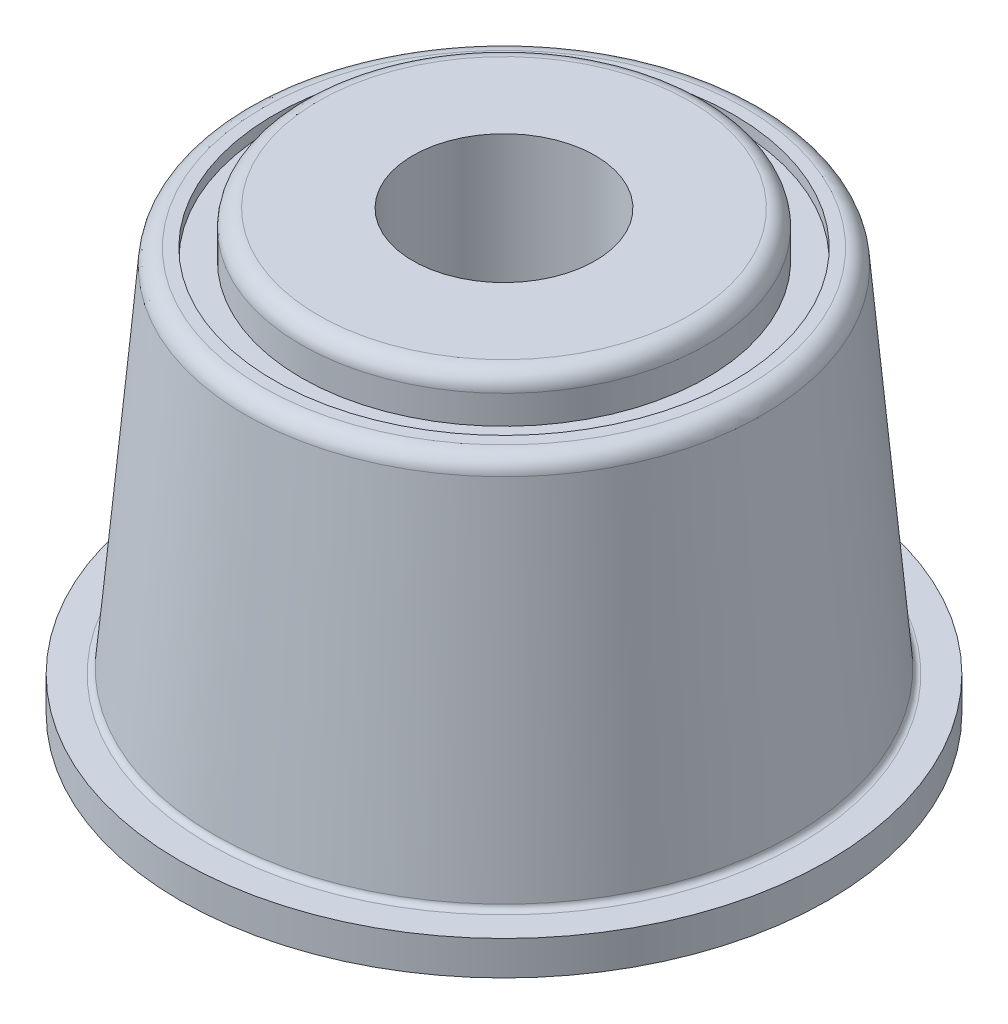
ISO-10303-21;
HEADER;
FILE_DESCRIPTION(('STEP AP214'),'2;1');
FILE_NAME('part.step','',(''),(''),'','','');
FILE_SCHEMA(('AUTOMOTIVE_DESIGN { 1 0 10303 214 1 1 1 1 }'));
ENDSEC;
DATA;
#1=APPLICATION_CONTEXT('core data for automotive mechanical design processes');
#2=APPLICATION_PROTOCOL_DEFINITION('international standard','automotive_design',2000,#1);
#3=PRODUCT_CONTEXT('',#1,'mechanical');
#4=PRODUCT('Part','Part','',(#3));
#5=PRODUCT_RELATED_PRODUCT_CATEGORY('part','',(#4));
#6=PRODUCT_DEFINITION_FORMATION('','',#4);
#7=PRODUCT_DEFINITION_CONTEXT('part definition',#1,'design');
#8=PRODUCT_DEFINITION('design','',#6,#7);
#9=PRODUCT_DEFINITION_SHAPE('','',#8);
#10=(LENGTH_UNIT() NAMED_UNIT(*) SI_UNIT(.MILLI.,.METRE.));
#11=(NAMED_UNIT(*) PLANE_ANGLE_UNIT() SI_UNIT($,.RADIAN.));
#12=(NAMED_UNIT(*) SI_UNIT($,.STERADIAN.) SOLID_ANGLE_UNIT());
#13=UNCERTAINTY_MEASURE_WITH_UNIT(LENGTH_MEASURE(1.E-05),#10,'distance_accuracy_value','');
#14=(GEOMETRIC_REPRESENTATION_CONTEXT(3) GLOBAL_UNCERTAINTY_ASSIGNED_CONTEXT((#13)) GLOBAL_UNIT_ASSIGNED_CONTEXT((#10,
#11,#12)) REPRESENTATION_CONTEXT('',''));
#15=CARTESIAN_POINT('',(0.,0.,0.));
#16=DIRECTION('',(0.,0.,1.));
#17=DIRECTION('',(1.,0.,0.));
#18=AXIS2_PLACEMENT_3D('',#15,#16,#17);
#19=CARTESIAN_POINT('',(0.,9.225,0.));
#20=DIRECTION('',(0.,-1.,0.));
#21=DIRECTION('',(0.,0.,-1.));
#22=AXIS2_PLACEMENT_3D('',#19,#20,#21);
#23=TOROIDAL_SURFACE('',#22,4.07,0.374999999999999);
#24=CARTESIAN_POINT('',(0.,9.6,0.));
#25=DIRECTION('',(0.,-1.,0.));
#26=DIRECTION('',(0.,0.,-1.));
#27=AXIS2_PLACEMENT_3D('',#24,#25,#26);
#28=CIRCLE('',#27,4.07);
#29=CARTESIAN_POINT('',(0.,9.6,-4.07));
#30=VERTEX_POINT('',#29);
#31=EDGE_CURVE('E10',#30,#30,#28,.T.);
#32=ORIENTED_EDGE('',*,*,#31,.T.);
#33=EDGE_LOOP('',(#32));
#34=FACE_BOUND('',#33,.T.);
#35=CARTESIAN_POINT('',(0.,9.225,0.));
#36=DIRECTION('',(0.,-1.,0.));
#37=DIRECTION('',(0.,0.,-1.));
#38=AXIS2_PLACEMENT_3D('',#35,#36,#37);
#39=CIRCLE('',#38,4.445);
#40=CARTESIAN_POINT('',(0.,9.225,-4.445));
#41=VERTEX_POINT('',#40);
#42=EDGE_CURVE('E80',#41,#41,#39,.T.);
#43=ORIENTED_EDGE('',*,*,#42,.F.);
#44=EDGE_LOOP('',(#43));
#45=FACE_BOUND('',#44,.T.);
#46=ADVANCED_FACE('F28',(#34,#45),#23,.T.);
#47=CARTESIAN_POINT('',(4.07,9.6,0.));
#48=DIRECTION('',(0.,1.,0.));
#49=DIRECTION('',(0.,0.,1.));
#50=AXIS2_PLACEMENT_3D('',#47,#48,#49);
#51=PLANE('',#50);
#52=CARTESIAN_POINT('',(0.,9.6,0.));
#53=DIRECTION('',(0.,-1.,0.));
#54=DIRECTION('',(0.,0.,-1.));
#55=AXIS2_PLACEMENT_3D('',#52,#53,#54);
#56=CIRCLE('',#55,2.);
#57=CARTESIAN_POINT('',(0.,9.6,-2.));
#58=VERTEX_POINT('',#57);
#59=EDGE_CURVE('E34',#58,#58,#56,.T.);
#60=ORIENTED_EDGE('',*,*,#59,.T.);
#61=EDGE_LOOP('',(#60));
#62=FACE_BOUND('',#61,.T.);
#63=ORIENTED_EDGE('',*,*,#31,.F.);
#64=EDGE_LOOP('',(#63));
#65=FACE_BOUND('',#64,.T.);
#66=ADVANCED_FACE('F88',(#62,#65),#51,.T.);
#67=CARTESIAN_POINT('',(0.,9.60267581021841,0.));
#68=DIRECTION('',(0.,-1.,0.));
#69=DIRECTION('',(0.,0.,-1.));
#70=AXIS2_PLACEMENT_3D('',#67,#68,#69);
#71=CYLINDRICAL_SURFACE('',#70,2.);
#72=CARTESIAN_POINT('',(0.,-0.750000000000001,0.));
#73=DIRECTION('',(0.,-1.,0.));
#74=DIRECTION('',(0.,0.,-1.));
#75=AXIS2_PLACEMENT_3D('',#72,#73,#74);
#76=CIRCLE('',#75,2.);
#77=CARTESIAN_POINT('',(0.,-0.750000000000001,-2.));
#78=VERTEX_POINT('',#77);
#79=EDGE_CURVE('E38',#78,#78,#76,.T.);
#80=ORIENTED_EDGE('',*,*,#79,.T.);
#81=EDGE_LOOP('',(#80));
#82=FACE_BOUND('',#81,.T.);
#83=ORIENTED_EDGE('',*,*,#59,.F.);
#84=EDGE_LOOP('',(#83));
#85=FACE_BOUND('',#84,.T.);
#86=ADVANCED_FACE('F92',(#82,#85),#71,.F.);
#87=CARTESIAN_POINT('',(2.,-0.75,0.));
#88=DIRECTION('',(0.,-1.,0.));
#89=DIRECTION('',(0.,0.,-1.));
#90=AXIS2_PLACEMENT_3D('',#87,#88,#89);
#91=PLANE('',#90);
#92=CARTESIAN_POINT('',(0.,-0.750000000000001,0.));
#93=DIRECTION('',(0.,-1.,0.));
#94=DIRECTION('',(0.,0.,-1.));
#95=AXIS2_PLACEMENT_3D('',#92,#93,#94);
#96=CIRCLE('',#95,4.445);
#97=CARTESIAN_POINT('',(0.,-0.750000000000001,-4.445));
#98=VERTEX_POINT('',#97);
#99=EDGE_CURVE('E42',#98,#98,#96,.T.);
#100=ORIENTED_EDGE('',*,*,#99,.T.);
#101=EDGE_LOOP('',(#100));
#102=FACE_BOUND('',#101,.T.);
#103=ORIENTED_EDGE('',*,*,#79,.F.);
#104=EDGE_LOOP('',(#103));
#105=FACE_BOUND('',#104,.T.);
#106=ADVANCED_FACE('F96',(#102,#105),#91,.T.);
#107=CARTESIAN_POINT('',(0.,9.60267581021841,0.));
#108=DIRECTION('',(0.,-1.,0.));
#109=DIRECTION('',(0.,0.,-1.));
#110=AXIS2_PLACEMENT_3D('',#107,#108,#109);
#111=CYLINDRICAL_SURFACE('',#110,4.445);
#112=CARTESIAN_POINT('',(0.,-0.125,0.));
#113=DIRECTION('',(0.,-1.,0.));
#114=DIRECTION('',(0.,0.,-1.));
#115=AXIS2_PLACEMENT_3D('',#112,#113,#114);
#116=CIRCLE('',#115,4.445);
#117=CARTESIAN_POINT('',(0.,-0.125,-4.445));
#118=VERTEX_POINT('',#117);
#119=EDGE_CURVE('E47',#118,#118,#116,.T.);
#120=ORIENTED_EDGE('',*,*,#119,.T.);
#121=EDGE_LOOP('',(#120));
#122=FACE_BOUND('',#121,.T.);
#123=ORIENTED_EDGE('',*,*,#99,.F.);
#124=EDGE_LOOP('',(#123));
#125=FACE_BOUND('',#124,.T.);
#126=ADVANCED_FACE('F103',(#122,#125),#111,.T.);
#127=CARTESIAN_POINT('',(0.,-0.125,0.));
#128=DIRECTION('',(0.,-1.,0.));
#129=DIRECTION('',(0.,0.,-1.));
#130=AXIS2_PLACEMENT_3D('',#127,#128,#129);
#131=TOROIDAL_SURFACE('',#130,4.57,0.125);
#132=CARTESIAN_POINT('',(0.,0.,0.));
#133=DIRECTION('',(0.,-1.,0.));
#134=DIRECTION('',(0.,0.,-1.));
#135=AXIS2_PLACEMENT_3D('',#132,#133,#134);
#136=CIRCLE('',#135,4.57);
#137=CARTESIAN_POINT('',(0.,0.,-4.57));
#138=VERTEX_POINT('',#137);
#139=EDGE_CURVE('E50',#138,#138,#136,.T.);
#140=ORIENTED_EDGE('',*,*,#139,.T.);
#141=EDGE_LOOP('',(#140));
#142=FACE_BOUND('',#141,.T.);
#143=ORIENTED_EDGE('',*,*,#119,.F.);
#144=EDGE_LOOP('',(#143));
#145=FACE_BOUND('',#144,.T.);
#146=ADVANCED_FACE('F107',(#142,#145),#131,.F.);
#147=CARTESIAN_POINT('',(4.57,0.,0.));
#148=DIRECTION('',(0.,-1.,0.));
#149=DIRECTION('',(0.,0.,-1.));
#150=AXIS2_PLACEMENT_3D('',#147,#148,#149);
#151=PLANE('',#150);
#152=CARTESIAN_POINT('',(0.,0.,0.));
#153=DIRECTION('',(0.,-1.,0.));
#154=DIRECTION('',(0.,0.,-1.));
#155=AXIS2_PLACEMENT_3D('',#152,#153,#154);
#156=CIRCLE('',#155,7.1);
#157=CARTESIAN_POINT('',(0.,0.,-7.1));
#158=VERTEX_POINT('',#157);
#159=EDGE_CURVE('E53',#158,#158,#156,.T.);
#160=ORIENTED_EDGE('',*,*,#159,.T.);
#161=EDGE_LOOP('',(#160));
#162=FACE_BOUND('',#161,.T.);
#163=ORIENTED_EDGE('',*,*,#139,.F.);
#164=EDGE_LOOP('',(#163));
#165=FACE_BOUND('',#164,.T.);
#166=ADVANCED_FACE('F111',(#162,#165),#151,.T.);
#167=CARTESIAN_POINT('',(0.,9.60267581021841,0.));
#168=DIRECTION('',(0.,-1.,0.));
#169=DIRECTION('',(0.,0.,-1.));
#170=AXIS2_PLACEMENT_3D('',#167,#168,#169);
#171=CYLINDRICAL_SURFACE('',#170,7.1);
#172=CARTESIAN_POINT('',(0.,0.750000000002596,0.));
#173=DIRECTION('',(0.,-1.,0.));
#174=DIRECTION('',(0.,0.,-1.));
#175=AXIS2_PLACEMENT_3D('',#172,#173,#174);
#176=CIRCLE('',#175,7.1);
#177=CARTESIAN_POINT('',(0.,0.750000000002596,-7.1));
#178=VERTEX_POINT('',#177);
#179=EDGE_CURVE('E56',#178,#178,#176,.T.);
#180=ORIENTED_EDGE('',*,*,#179,.T.);
#181=EDGE_LOOP('',(#180));
#182=FACE_BOUND('',#181,.T.);
#183=ORIENTED_EDGE('',*,*,#159,.F.);
#184=EDGE_LOOP('',(#183));
#185=FACE_BOUND('',#184,.T.);
#186=ADVANCED_FACE('F115',(#182,#185),#171,.T.);
#187=CARTESIAN_POINT('',(7.1,0.750000000002595,0.));
#188=DIRECTION('',(0.,1.,0.));
#189=DIRECTION('',(0.,0.,1.));
#190=AXIS2_PLACEMENT_3D('',#187,#188,#189);
#191=PLANE('',#190);
#192=CARTESIAN_POINT('',(0.,0.750000000002596,0.));
#193=DIRECTION('',(0.,-1.,0.));
#194=DIRECTION('',(0.,0.,-1.));
#195=AXIS2_PLACEMENT_3D('',#192,#193,#194);
#196=CIRCLE('',#195,6.46454139675438);
#197=CARTESIAN_POINT('',(0.,0.750000000002596,-6.46454139675438));
#198=VERTEX_POINT('',#197);
#199=EDGE_CURVE('E59',#198,#198,#196,.T.);
#200=ORIENTED_EDGE('',*,*,#199,.T.);
#201=EDGE_LOOP('',(#200));
#202=FACE_BOUND('',#201,.T.);
#203=ORIENTED_EDGE('',*,*,#179,.F.);
#204=EDGE_LOOP('',(#203));
#205=FACE_BOUND('',#204,.T.);
#206=ADVANCED_FACE('F119',(#202,#205),#191,.T.);
#207=CARTESIAN_POINT('',(0.,0.875000000005468,0.));
#208=DIRECTION('',(0.,-1.,0.));
#209=DIRECTION('',(0.,0.,-1.));
#210=AXIS2_PLACEMENT_3D('',#207,#208,#209);
#211=TOROIDAL_SURFACE('',#210,6.46454139675438,0.125000000002873);
#212=CARTESIAN_POINT('',(0.,0.864105532161678,0.));
#213=DIRECTION('',(0.,-1.,0.));
#214=DIRECTION('',(0.,0.,-1.));
#215=AXIS2_PLACEMENT_3D('',#212,#213,#214);
#216=CIRCLE('',#215,6.34001705949006);
#217=CARTESIAN_POINT('',(0.,0.864105532161678,-6.34001705949006));
#218=VERTEX_POINT('',#217);
#219=EDGE_CURVE('E62',#218,#218,#216,.T.);
#220=ORIENTED_EDGE('',*,*,#219,.T.);
#221=EDGE_LOOP('',(#220));
#222=FACE_BOUND('',#221,.T.);
#223=ORIENTED_EDGE('',*,*,#199,.F.);
#224=EDGE_LOOP('',(#223));
#225=FACE_BOUND('',#224,.T.);
#226=ADVANCED_FACE('F123',(#222,#225),#211,.F.);
#227=CARTESIAN_POINT('',(0.,0.864105532161678,0.));
#228=DIRECTION('',(0.,-1.,0.));
#229=DIRECTION('',(0.,0.,-1.));
#230=AXIS2_PLACEMENT_3D('',#227,#228,#229);
#231=CONICAL_SURFACE('',#230,6.34001705949006,0.0872664626003782);
#232=CARTESIAN_POINT('',(0.,8.50768340353542,0.));
#233=DIRECTION('',(0.,-1.,0.));
#234=DIRECTION('',(0.,0.,-1.));
#235=AXIS2_PLACEMENT_3D('',#232,#233,#234);
#236=CIRCLE('',#235,5.67129064696214);
#237=CARTESIAN_POINT('',(0.,8.50768340353542,-5.67129064696214));
#238=VERTEX_POINT('',#237);
#239=EDGE_CURVE('E65',#238,#238,#236,.T.);
#240=ORIENTED_EDGE('',*,*,#239,.T.);
#241=EDGE_LOOP('',(#240));
#242=FACE_BOUND('',#241,.T.);
#243=ORIENTED_EDGE('',*,*,#219,.F.);
#244=EDGE_LOOP('',(#243));
#245=FACE_BOUND('',#244,.T.);
#246=ADVANCED_FACE('F127',(#242,#245),#231,.T.);
#247=CARTESIAN_POINT('',(0.,8.47500000000526,0.));
#248=DIRECTION('',(0.,-1.,0.));
#249=DIRECTION('',(0.,0.,-1.));
#250=AXIS2_PLACEMENT_3D('',#247,#248,#249);
#251=TOROIDAL_SURFACE('',#250,5.297717635183,0.37499999999474);
#252=CARTESIAN_POINT('',(0.,8.85,0.));
#253=DIRECTION('',(0.,-1.,0.));
#254=DIRECTION('',(0.,0.,-1.));
#255=AXIS2_PLACEMENT_3D('',#252,#253,#254);
#256=CIRCLE('',#255,5.297717635183);
#257=CARTESIAN_POINT('',(0.,8.85,-5.297717635183));
#258=VERTEX_POINT('',#257);
#259=EDGE_CURVE('E68',#258,#258,#256,.T.);
#260=ORIENTED_EDGE('',*,*,#259,.T.);
#261=EDGE_LOOP('',(#260));
#262=FACE_BOUND('',#261,.T.);
#263=ORIENTED_EDGE('',*,*,#239,.F.);
#264=EDGE_LOOP('',(#263));
#265=FACE_BOUND('',#264,.T.);
#266=ADVANCED_FACE('F131',(#262,#265),#251,.T.);
#267=CARTESIAN_POINT('',(5.297717635183,8.85,0.));
#268=DIRECTION('',(0.,1.,0.));
#269=DIRECTION('',(0.,0.,1.));
#270=AXIS2_PLACEMENT_3D('',#267,#268,#269);
#271=PLANE('',#270);
#272=CARTESIAN_POINT('',(0.,8.85,0.));
#273=DIRECTION('',(0.,-1.,0.));
#274=DIRECTION('',(0.,0.,-1.));
#275=AXIS2_PLACEMENT_3D('',#272,#273,#274);
#276=CIRCLE('',#275,5.04317091272);
#277=CARTESIAN_POINT('',(0.,8.85,-5.04317091272));
#278=VERTEX_POINT('',#277);
#279=EDGE_CURVE('E71',#278,#278,#276,.T.);
#280=ORIENTED_EDGE('',*,*,#279,.T.);
#281=EDGE_LOOP('',(#280));
#282=FACE_BOUND('',#281,.T.);
#283=ORIENTED_EDGE('',*,*,#259,.F.);
#284=EDGE_LOOP('',(#283));
#285=FACE_BOUND('',#284,.T.);
#286=ADVANCED_FACE('F135',(#282,#285),#271,.T.);
#287=CARTESIAN_POINT('',(0.,9.60267581021841,0.));
#288=DIRECTION('',(0.,-1.,0.));
#289=DIRECTION('',(0.,0.,-1.));
#290=AXIS2_PLACEMENT_3D('',#287,#288,#289);
#291=CYLINDRICAL_SURFACE('',#290,5.04317091272);
#292=CARTESIAN_POINT('',(0.,8.6,0.));
#293=DIRECTION('',(0.,-1.,0.));
#294=DIRECTION('',(0.,0.,-1.));
#295=AXIS2_PLACEMENT_3D('',#292,#293,#294);
#296=CIRCLE('',#295,5.04317091272);
#297=CARTESIAN_POINT('',(0.,8.6,-5.04317091272));
#298=VERTEX_POINT('',#297);
#299=EDGE_CURVE('E74',#298,#298,#296,.T.);
#300=ORIENTED_EDGE('',*,*,#299,.T.);
#301=EDGE_LOOP('',(#300));
#302=FACE_BOUND('',#301,.T.);
#303=ORIENTED_EDGE('',*,*,#279,.F.);
#304=EDGE_LOOP('',(#303));
#305=FACE_BOUND('',#304,.T.);
#306=ADVANCED_FACE('F139',(#302,#305),#291,.F.);
#307=CARTESIAN_POINT('',(5.04317091272,8.6,0.));
#308=DIRECTION('',(0.,1.,0.));
#309=DIRECTION('',(0.,0.,1.));
#310=AXIS2_PLACEMENT_3D('',#307,#308,#309);
#311=PLANE('',#310);
#312=CARTESIAN_POINT('',(0.,8.6,0.));
#313=DIRECTION('',(0.,-1.,0.));
#314=DIRECTION('',(0.,0.,-1.));
#315=AXIS2_PLACEMENT_3D('',#312,#313,#314);
#316=CIRCLE('',#315,4.445);
#317=CARTESIAN_POINT('',(0.,8.6,-4.445));
#318=VERTEX_POINT('',#317);
#319=EDGE_CURVE('E77',#318,#318,#316,.T.);
#320=ORIENTED_EDGE('',*,*,#319,.T.);
#321=EDGE_LOOP('',(#320));
#322=FACE_BOUND('',#321,.T.);
#323=ORIENTED_EDGE('',*,*,#299,.F.);
#324=EDGE_LOOP('',(#323));
#325=FACE_BOUND('',#324,.T.);
#326=ADVANCED_FACE('F143',(#322,#325),#311,.T.);
#327=CARTESIAN_POINT('',(0.,9.60267581021841,0.));
#328=DIRECTION('',(0.,-1.,0.));
#329=DIRECTION('',(0.,0.,-1.));
#330=AXIS2_PLACEMENT_3D('',#327,#328,#329);
#331=CYLINDRICAL_SURFACE('',#330,4.445);
#332=ORIENTED_EDGE('',*,*,#42,.T.);
#333=EDGE_LOOP('',(#332));
#334=FACE_BOUND('',#333,.T.);
#335=ORIENTED_EDGE('',*,*,#319,.F.);
#336=EDGE_LOOP('',(#335));
#337=FACE_BOUND('',#336,.T.);
#338=ADVANCED_FACE('F84',(#334,#337),#331,.T.);
#339=CLOSED_SHELL('',(#46,#66,#86,#106,#126,#146,#166,#186,#206,#226,#246,#266,#286,#306,#326,#338));
#340=MANIFOLD_SOLID_BREP('B2',#339);
#341=ADVANCED_BREP_SHAPE_REPRESENTATION('',(#18,#340),#14);
#342=SHAPE_DEFINITION_REPRESENTATION(#9,#341);
ENDSEC;
END-ISO-10303-21;
